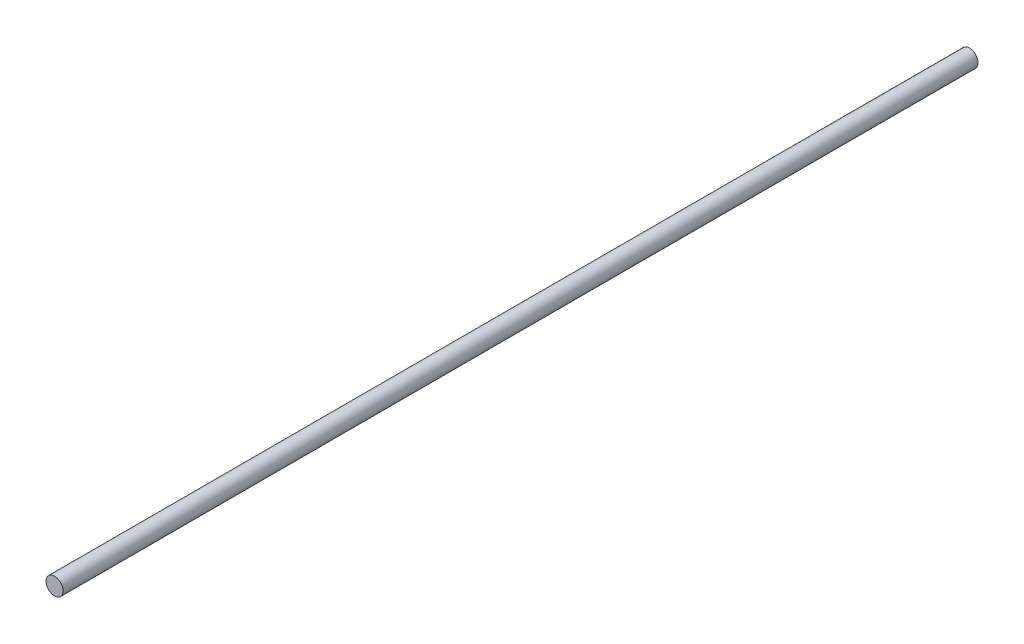
ISO-10303-21;
HEADER;
FILE_DESCRIPTION(('STEP AP214'),'2;1');
FILE_NAME('part.step','',(''),(''),'','','');
FILE_SCHEMA(('AUTOMOTIVE_DESIGN { 1 0 10303 214 1 1 1 1 }'));
ENDSEC;
DATA;
#1=APPLICATION_CONTEXT('core data for automotive mechanical design processes');
#2=APPLICATION_PROTOCOL_DEFINITION('international standard','automotive_design',2000,#1);
#3=PRODUCT_CONTEXT('',#1,'mechanical');
#4=PRODUCT('Part','Part','',(#3));
#5=PRODUCT_RELATED_PRODUCT_CATEGORY('part','',(#4));
#6=PRODUCT_DEFINITION_FORMATION('','',#4);
#7=PRODUCT_DEFINITION_CONTEXT('part definition',#1,'design');
#8=PRODUCT_DEFINITION('design','',#6,#7);
#9=PRODUCT_DEFINITION_SHAPE('','',#8);
#10=(LENGTH_UNIT() NAMED_UNIT(*) SI_UNIT(.MILLI.,.METRE.));
#11=(NAMED_UNIT(*) PLANE_ANGLE_UNIT() SI_UNIT($,.RADIAN.));
#12=(NAMED_UNIT(*) SI_UNIT($,.STERADIAN.) SOLID_ANGLE_UNIT());
#13=UNCERTAINTY_MEASURE_WITH_UNIT(LENGTH_MEASURE(1.E-05),#10,'distance_accuracy_value','');
#14=(GEOMETRIC_REPRESENTATION_CONTEXT(3) GLOBAL_UNCERTAINTY_ASSIGNED_CONTEXT((#13)) GLOBAL_UNIT_ASSIGNED_CONTEXT((#10,
#11,#12)) REPRESENTATION_CONTEXT('',''));
#15=CARTESIAN_POINT('',(0.,0.,0.));
#16=DIRECTION('',(0.,0.,1.));
#17=DIRECTION('',(1.,0.,0.));
#18=AXIS2_PLACEMENT_3D('',#15,#16,#17);
#19=CARTESIAN_POINT('',(0.,0.,320.));
#20=DIRECTION('',(0.,0.,-1.));
#21=DIRECTION('',(-1.,0.,0.));
#22=AXIS2_PLACEMENT_3D('',#19,#20,#21);
#23=CYLINDRICAL_SURFACE('',#22,3.);
#24=CARTESIAN_POINT('',(0.,0.,320.));
#25=DIRECTION('',(0.,0.,1.));
#26=DIRECTION('',(1.,0.,0.));
#27=AXIS2_PLACEMENT_3D('',#24,#25,#26);
#28=CIRCLE('',#27,3.);
#29=CARTESIAN_POINT('',(3.,0.,320.));
#30=VERTEX_POINT('',#29);
#31=EDGE_CURVE('E10',#30,#30,#28,.T.);
#32=ORIENTED_EDGE('',*,*,#31,.F.);
#33=EDGE_LOOP('',(#32));
#34=FACE_BOUND('',#33,.T.);
#35=CARTESIAN_POINT('',(0.,0.,0.));
#36=DIRECTION('',(0.,0.,1.));
#37=DIRECTION('',(1.,0.,0.));
#38=AXIS2_PLACEMENT_3D('',#35,#36,#37);
#39=CIRCLE('',#38,3.);
#40=CARTESIAN_POINT('',(3.,0.,0.));
#41=VERTEX_POINT('',#40);
#42=EDGE_CURVE('E34',#41,#41,#39,.T.);
#43=ORIENTED_EDGE('',*,*,#42,.T.);
#44=EDGE_LOOP('',(#43));
#45=FACE_BOUND('',#44,.T.);
#46=ADVANCED_FACE('F31',(#34,#45),#23,.T.);
#47=CARTESIAN_POINT('',(0.,0.,320.));
#48=DIRECTION('',(0.,0.,1.));
#49=DIRECTION('',(1.,0.,0.));
#50=AXIS2_PLACEMENT_3D('',#47,#48,#49);
#51=PLANE('',#50);
#52=ORIENTED_EDGE('',*,*,#31,.T.);
#53=EDGE_LOOP('',(#52));
#54=FACE_BOUND('',#53,.T.);
#55=ADVANCED_FACE('F46',(#54),#51,.T.);
#56=CARTESIAN_POINT('',(0.,0.,0.));
#57=DIRECTION('',(0.,0.,1.));
#58=DIRECTION('',(1.,0.,0.));
#59=AXIS2_PLACEMENT_3D('',#56,#57,#58);
#60=PLANE('',#59);
#61=ORIENTED_EDGE('',*,*,#42,.F.);
#62=EDGE_LOOP('',(#61));
#63=FACE_BOUND('',#62,.T.);
#64=ADVANCED_FACE('F44',(#63),#60,.F.);
#65=CLOSED_SHELL('',(#46,#55,#64));
#66=MANIFOLD_SOLID_BREP('B2',#65);
#67=ADVANCED_BREP_SHAPE_REPRESENTATION('',(#18,#66),#14);
#68=SHAPE_DEFINITION_REPRESENTATION(#9,#67);
ENDSEC;
END-ISO-10303-21;
